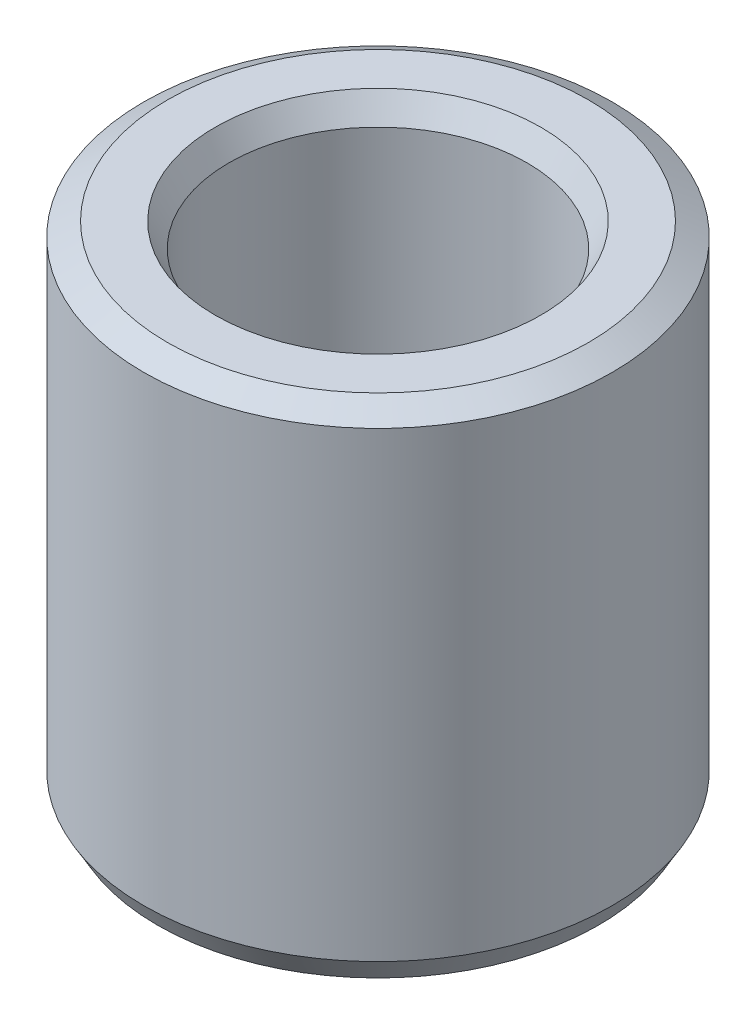
ISO-10303-21;
HEADER;
FILE_DESCRIPTION(('STEP AP214'),'2;1');
FILE_NAME('part.step','',(''),(''),'','','');
FILE_SCHEMA(('AUTOMOTIVE_DESIGN { 1 0 10303 214 1 1 1 1 }'));
ENDSEC;
DATA;
#1=APPLICATION_CONTEXT('core data for automotive mechanical design processes');
#2=APPLICATION_PROTOCOL_DEFINITION('international standard','automotive_design',2000,#1);
#3=PRODUCT_CONTEXT('',#1,'mechanical');
#4=PRODUCT('Part','Part','',(#3));
#5=PRODUCT_RELATED_PRODUCT_CATEGORY('part','',(#4));
#6=PRODUCT_DEFINITION_FORMATION('','',#4);
#7=PRODUCT_DEFINITION_CONTEXT('part definition',#1,'design');
#8=PRODUCT_DEFINITION('design','',#6,#7);
#9=PRODUCT_DEFINITION_SHAPE('','',#8);
#10=(LENGTH_UNIT() NAMED_UNIT(*) SI_UNIT(.MILLI.,.METRE.));
#11=(NAMED_UNIT(*) PLANE_ANGLE_UNIT() SI_UNIT($,.RADIAN.));
#12=(NAMED_UNIT(*) SI_UNIT($,.STERADIAN.) SOLID_ANGLE_UNIT());
#13=UNCERTAINTY_MEASURE_WITH_UNIT(LENGTH_MEASURE(1.E-05),#10,'distance_accuracy_value','');
#14=(GEOMETRIC_REPRESENTATION_CONTEXT(3) GLOBAL_UNCERTAINTY_ASSIGNED_CONTEXT((#13)) GLOBAL_UNIT_ASSIGNED_CONTEXT((#10,
#11,#12)) REPRESENTATION_CONTEXT('',''));
#15=CARTESIAN_POINT('',(0.,0.,0.));
#16=DIRECTION('',(0.,0.,1.));
#17=DIRECTION('',(1.,0.,0.));
#18=AXIS2_PLACEMENT_3D('',#15,#16,#17);
#19=CARTESIAN_POINT('',(0.,95.9526361688887,0.));
#20=DIRECTION('',(0.,-1.,0.));
#21=DIRECTION('',(0.,0.,-1.));
#22=AXIS2_PLACEMENT_3D('',#19,#20,#21);
#23=CYLINDRICAL_SURFACE('',#22,45.);
#24=CARTESIAN_POINT('',(0.,4.59350722809722,0.));
#25=DIRECTION('',(0.,1.,0.));
#26=DIRECTION('',(0.,0.,1.));
#27=AXIS2_PLACEMENT_3D('',#24,#25,#26);
#28=CIRCLE('',#27,45.);
#29=CARTESIAN_POINT('',(0.,4.59350722809722,45.));
#30=VERTEX_POINT('',#29);
#31=EDGE_CURVE('E10',#30,#30,#28,.T.);
#32=ORIENTED_EDGE('',*,*,#31,.T.);
#33=EDGE_LOOP('',(#32));
#34=FACE_BOUND('',#33,.T.);
#35=CARTESIAN_POINT('',(0.,93.3005735342223,0.));
#36=DIRECTION('',(0.,1.,0.));
#37=DIRECTION('',(0.,0.,1.));
#38=AXIS2_PLACEMENT_3D('',#35,#36,#37);
#39=CIRCLE('',#38,45.);
#40=CARTESIAN_POINT('',(0.,93.3005735342223,45.));
#41=VERTEX_POINT('',#40);
#42=EDGE_CURVE('E50',#41,#41,#39,.F.);
#43=ORIENTED_EDGE('',*,*,#42,.T.);
#44=EDGE_LOOP('',(#43));
#45=FACE_BOUND('',#44,.T.);
#46=ADVANCED_FACE('F39',(#34,#45),#23,.T.);
#47=CARTESIAN_POINT('',(0.,95.9526361688887,0.));
#48=DIRECTION('',(0.,1.,0.));
#49=DIRECTION('',(0.,0.,1.));
#50=AXIS2_PLACEMENT_3D('',#47,#48,#49);
#51=PLANE('',#50);
#52=CARTESIAN_POINT('',(0.,95.9526361688887,0.));
#53=DIRECTION('',(0.,1.,0.));
#54=DIRECTION('',(0.,0.,1.));
#55=AXIS2_PLACEMENT_3D('',#52,#53,#54);
#56=CIRCLE('',#55,31.2816265162041);
#57=CARTESIAN_POINT('',(0.,95.9526361688887,31.2816265162041));
#58=VERTEX_POINT('',#57);
#59=EDGE_CURVE('E58',#58,#58,#56,.F.);
#60=ORIENTED_EDGE('',*,*,#59,.T.);
#61=EDGE_LOOP('',(#60));
#62=FACE_BOUND('',#61,.T.);
#63=CARTESIAN_POINT('',(0.,95.9526361688887,0.));
#64=DIRECTION('',(0.,1.,0.));
#65=DIRECTION('',(0.,0.,1.));
#66=AXIS2_PLACEMENT_3D('',#63,#64,#65);
#67=CIRCLE('',#66,40.4064927719028);
#68=CARTESIAN_POINT('',(0.,95.9526361688887,40.4064927719028));
#69=VERTEX_POINT('',#68);
#70=EDGE_CURVE('E61',#69,#69,#67,.T.);
#71=ORIENTED_EDGE('',*,*,#70,.T.);
#72=EDGE_LOOP('',(#71));
#73=FACE_BOUND('',#72,.T.);
#74=ADVANCED_FACE('F88',(#62,#73),#51,.T.);
#75=CARTESIAN_POINT('',(0.,0.,0.));
#76=DIRECTION('',(0.,1.,0.));
#77=DIRECTION('',(0.,0.,1.));
#78=AXIS2_PLACEMENT_3D('',#75,#76,#77);
#79=PLANE('',#78);
#80=CARTESIAN_POINT('',(0.,0.,0.));
#81=DIRECTION('',(0.,1.,0.));
#82=DIRECTION('',(0.,0.,1.));
#83=AXIS2_PLACEMENT_3D('',#80,#81,#82);
#84=CIRCLE('',#83,33.2230711096348);
#85=CARTESIAN_POINT('',(0.,0.,-33.2230711096348));
#86=VERTEX_POINT('',#85);
#87=EDGE_CURVE('E51',#86,#86,#84,.T.);
#88=ORIENTED_EDGE('',*,*,#87,.T.);
#89=EDGE_LOOP('',(#88));
#90=FACE_BOUND('',#89,.T.);
#91=CARTESIAN_POINT('',(0.,0.,0.));
#92=DIRECTION('',(0.,1.,0.));
#93=DIRECTION('',(0.,0.,1.));
#94=AXIS2_PLACEMENT_3D('',#91,#92,#93);
#95=CIRCLE('',#94,42.3479373653336);
#96=CARTESIAN_POINT('',(0.,0.,42.3479373653336));
#97=VERTEX_POINT('',#96);
#98=EDGE_CURVE('E54',#97,#97,#95,.F.);
#99=ORIENTED_EDGE('',*,*,#98,.T.);
#100=EDGE_LOOP('',(#99));
#101=FACE_BOUND('',#100,.T.);
#102=ADVANCED_FACE('F83',(#90,#101),#79,.F.);
#103=CARTESIAN_POINT('',(0.,95.9526361688887,0.));
#104=DIRECTION('',(0.,-1.,0.));
#105=DIRECTION('',(0.,0.,-1.));
#106=AXIS2_PLACEMENT_3D('',#103,#104,#105);
#107=CYLINDRICAL_SURFACE('',#106,28.6295638815376);
#108=CARTESIAN_POINT('',(0.,91.3591289407915,0.));
#109=DIRECTION('',(0.,1.,0.));
#110=DIRECTION('',(0.,0.,1.));
#111=AXIS2_PLACEMENT_3D('',#108,#109,#110);
#112=CIRCLE('',#111,28.6295638815376);
#113=CARTESIAN_POINT('',(0.,91.3591289407915,28.6295638815376));
#114=VERTEX_POINT('',#113);
#115=EDGE_CURVE('E67',#114,#114,#112,.T.);
#116=ORIENTED_EDGE('',*,*,#115,.T.);
#117=EDGE_LOOP('',(#116));
#118=FACE_BOUND('',#117,.T.);
#119=CARTESIAN_POINT('',(0.,2.65206263466644,0.));
#120=DIRECTION('',(0.,1.,0.));
#121=DIRECTION('',(0.,0.,1.));
#122=AXIS2_PLACEMENT_3D('',#119,#120,#121);
#123=CIRCLE('',#122,28.6295638815376);
#124=CARTESIAN_POINT('',(0.,2.65206263466644,-28.6295638815376));
#125=VERTEX_POINT('',#124);
#126=EDGE_CURVE('E69',#125,#125,#123,.F.);
#127=ORIENTED_EDGE('',*,*,#126,.T.);
#128=EDGE_LOOP('',(#127));
#129=FACE_BOUND('',#128,.T.);
#130=ADVANCED_FACE('F71',(#118,#129),#107,.F.);
#131=CARTESIAN_POINT('',(0.,91.3591289407915,0.));
#132=DIRECTION('',(0.,1.,0.));
#133=DIRECTION('',(0.,0.,1.));
#134=AXIS2_PLACEMENT_3D('',#131,#132,#133);
#135=CONICAL_SURFACE('',#134,28.6295638815376,0.523598775598304);
#136=ORIENTED_EDGE('',*,*,#59,.F.);
#137=EDGE_LOOP('',(#136));
#138=FACE_BOUND('',#137,.T.);
#139=ORIENTED_EDGE('',*,*,#115,.F.);
#140=EDGE_LOOP('',(#139));
#141=FACE_BOUND('',#140,.T.);
#142=ADVANCED_FACE('F77',(#138,#141),#135,.F.);
#143=CARTESIAN_POINT('',(0.,0.,0.));
#144=DIRECTION('',(0.,-1.,0.));
#145=DIRECTION('',(0.,0.,-1.));
#146=AXIS2_PLACEMENT_3D('',#143,#144,#145);
#147=CONICAL_SURFACE('',#146,33.2230711096348,1.04719755119659);
#148=CARTESIAN_POINT('',(0.,2.65206263466644,-28.6295638815376));
#149=CARTESIAN_POINT('',(0.,2.624436982222,-28.6774129151636));
#150=CARTESIAN_POINT('',(0.,2.59681132977756,-28.7252619487896));
#151=CARTESIAN_POINT('',(0.,2.54156002488867,-28.8209600160416));
#152=CARTESIAN_POINT('',(0.,2.51393437244423,-28.8688090496676));
#153=CARTESIAN_POINT('',(0.,2.45868306755535,-28.9645071169197));
#154=CARTESIAN_POINT('',(0.,2.4310574151109,-29.0123561505457));
#155=CARTESIAN_POINT('',(0.,2.37580611022202,-29.1080542177977));
#156=CARTESIAN_POINT('',(0.,2.34818045777758,-29.1559032514237));
#157=CARTESIAN_POINT('',(0.,2.29292915288869,-29.2516013186757));
#158=CARTESIAN_POINT('',(0.,2.26530350044425,-29.2994503523018));
#159=CARTESIAN_POINT('',(0.,2.21005219555537,-29.3951484195538));
#160=CARTESIAN_POINT('',(0.,2.18242654311093,-29.4429974531798));
#161=CARTESIAN_POINT('',(0.,2.12717523822204,-29.5386955204318));
#162=CARTESIAN_POINT('',(0.,2.0995495857776,-29.5865445540578));
#163=CARTESIAN_POINT('',(0.,2.04429828088871,-29.6822426213099));
#164=CARTESIAN_POINT('',(0.,2.01667262844427,-29.7300916549359));
#165=CARTESIAN_POINT('',(0.,1.96142132355539,-29.8257897221879));
#166=CARTESIAN_POINT('',(0.,1.93379567111095,-29.8736387558139));
#167=CARTESIAN_POINT('',(0.,1.87854436622206,-29.9693368230659));
#168=CARTESIAN_POINT('',(0.,1.85091871377762,-30.0171858566919));
#169=CARTESIAN_POINT('',(0.,1.79566740888874,-30.112883923944));
#170=CARTESIAN_POINT('',(0.,1.76804175644429,-30.16073295757));
#171=CARTESIAN_POINT('',(0.,1.71279045155541,-30.256431024822));
#172=CARTESIAN_POINT('',(0.,1.68516479911097,-30.304280058448));
#173=CARTESIAN_POINT('',(0.,1.62991349422208,-30.3999781257));
#174=CARTESIAN_POINT('',(0.,1.60228784177764,-30.4478271593261));
#175=CARTESIAN_POINT('',(0.,1.54703653688876,-30.5435252265781));
#176=CARTESIAN_POINT('',(0.,1.51941088444432,-30.5913742602041));
#177=CARTESIAN_POINT('',(0.,1.46415957955543,-30.6870723274561));
#178=CARTESIAN_POINT('',(0.,1.43653392711099,-30.7349213610821));
#179=CARTESIAN_POINT('',(0.,1.3812826222221,-30.8306194283342));
#180=CARTESIAN_POINT('',(0.,1.35365696977766,-30.8784684619602));
#181=CARTESIAN_POINT('',(0.,1.29840566488878,-30.9741665292122));
#182=CARTESIAN_POINT('',(0.,1.27078001244434,-31.0220155628382));
#183=CARTESIAN_POINT('',(0.,1.21552870755545,-31.1177136300902));
#184=CARTESIAN_POINT('',(0.,1.18790305511101,-31.1655626637163));
#185=CARTESIAN_POINT('',(0.,1.13265175022213,-31.2612607309683));
#186=CARTESIAN_POINT('',(0.,1.10502609777768,-31.3091097645943));
#187=CARTESIAN_POINT('',(0.,1.0497747928888,-31.4048078318463));
#188=CARTESIAN_POINT('',(0.,1.02214914044436,-31.4526568654723));
#189=CARTESIAN_POINT('',(0.,0.966897835555474,-31.5483549327244));
#190=CARTESIAN_POINT('',(0.,0.939272183111031,-31.5962039663504));
#191=CARTESIAN_POINT('',(0.,0.884020878222147,-31.6919020336024));
#192=CARTESIAN_POINT('',(0.,0.856395225777705,-31.7397510672284));
#193=CARTESIAN_POINT('',(0.,0.801143920888821,-31.8354491344804));
#194=CARTESIAN_POINT('',(0.,0.773518268444378,-31.8832981681064));
#195=CARTESIAN_POINT('',(0.,0.718266963555494,-31.9789962353585));
#196=CARTESIAN_POINT('',(0.,0.690641311111053,-32.0268452689845));
#197=CARTESIAN_POINT('',(0.,0.635390006222169,-32.1225433362365));
#198=CARTESIAN_POINT('',(0.,0.607764353777726,-32.1703923698625));
#199=CARTESIAN_POINT('',(0.,0.552513048888841,-32.2660904371145));
#200=CARTESIAN_POINT('',(0.,0.524887396444399,-32.3139394707406));
#201=CARTESIAN_POINT('',(0.,0.469636091555515,-32.4096375379926));
#202=CARTESIAN_POINT('',(0.,0.442010439111074,-32.4574865716186));
#203=CARTESIAN_POINT('',(0.,0.38675913422219,-32.5531846388706));
#204=CARTESIAN_POINT('',(0.,0.359133481777747,-32.6010336724966));
#205=CARTESIAN_POINT('',(0.,0.303882176888863,-32.6967317397487));
#206=CARTESIAN_POINT('',(0.,0.276256524444421,-32.7445807733747));
#207=CARTESIAN_POINT('',(0.,0.221005219555537,-32.8402788406267));
#208=CARTESIAN_POINT('',(0.,0.193379567111094,-32.8881278742527));
#209=CARTESIAN_POINT('',(0.,0.13812826222221,-32.9838259415047));
#210=CARTESIAN_POINT('',(0.,0.110502609777768,-33.0316749751307));
#211=CARTESIAN_POINT('',(0.,0.0552513048888852,-33.1273730423828));
#212=CARTESIAN_POINT('',(0.,0.0276256524444436,-33.1752220760088));
#213=CARTESIAN_POINT('',(0.,0.,-33.2230711096348));
#214=B_SPLINE_CURVE_WITH_KNOTS('',3,(#148,#149,#150,#151,#152,#153,#154,#155,#156,#157,#158,
#159,#160,#161,#162,#163,#164,#165,#166,#167,#168,#169,#170,#171,#172,#173,#174,#175,#176,#177,
#178,#179,#180,#181,#182,#183,#184,#185,#186,#187,#188,#189,#190,#191,#192,#193,#194,#195,#196,
#197,#198,#199,#200,#201,#202,#203,#204,#205,#206,#207,#208,#209,#210,#211,#212,#213),
.UNSPECIFIED.,.F.,.F.,(4,2,2,2,2,2,2,2,2,2,2,2,2,2,2,2,2,2,2,2,2,2,2,2,2,2,2,2,2,2,2,2,4),(0.,
0.165753914666653,0.331507829333302,0.497261743999955,0.663015658666605,0.828769573333258,
0.99452348799991,1.16027740266656,1.32603131733321,1.49178523199986,1.65753914666652,
1.82329306133317,1.98904697599982,2.15480089066647,2.32055480533312,2.48630871999977,
2.65206263466642,2.81781654933307,2.98357046399972,3.14932437866637,3.31507829333303,
3.48083220799968,3.64658612266633,3.81234003733298,3.97809395199963,4.14384786666628,
4.30960178133293,4.47535569599959,4.64110961066624,4.80686352533289,4.97261743999954,
5.1383713546662,5.30412526933285),.UNSPECIFIED.);
#215=EDGE_CURVE('BSEAM73',#125,#86,#214,.T.);
#216=ORIENTED_EDGE('',*,*,#126,.F.);
#217=ORIENTED_EDGE('',*,*,#87,.F.);
#218=ORIENTED_EDGE('',*,*,#215,.T.);
#219=ORIENTED_EDGE('',*,*,#215,.F.);
#220=EDGE_LOOP('',(#216,#218,#217,#219));
#221=FACE_BOUND('',#220,.T.);
#222=ADVANCED_FACE('F73',(#221),#147,.F.);
#223=CARTESIAN_POINT('',(0.,4.59350722809722,0.));
#224=DIRECTION('',(0.,1.,0.));
#225=DIRECTION('',(0.,0.,1.));
#226=AXIS2_PLACEMENT_3D('',#223,#224,#225);
#227=CONICAL_SURFACE('',#226,45.,0.523598775598303);
#228=ORIENTED_EDGE('',*,*,#98,.F.);
#229=EDGE_LOOP('',(#228));
#230=FACE_BOUND('',#229,.T.);
#231=ORIENTED_EDGE('',*,*,#31,.F.);
#232=EDGE_LOOP('',(#231));
#233=FACE_BOUND('',#232,.T.);
#234=ADVANCED_FACE('F76',(#230,#233),#227,.T.);
#235=CARTESIAN_POINT('',(0.,95.9526361688887,0.));
#236=DIRECTION('',(0.,-1.,0.));
#237=DIRECTION('',(0.,0.,-1.));
#238=AXIS2_PLACEMENT_3D('',#235,#236,#237);
#239=CONICAL_SURFACE('',#238,40.4064927719028,1.04719755119659);
#240=ORIENTED_EDGE('',*,*,#42,.F.);
#241=EDGE_LOOP('',(#240));
#242=FACE_BOUND('',#241,.T.);
#243=ORIENTED_EDGE('',*,*,#70,.F.);
#244=EDGE_LOOP('',(#243));
#245=FACE_BOUND('',#244,.T.);
#246=ADVANCED_FACE('F45',(#242,#245),#239,.T.);
#247=CLOSED_SHELL('',(#46,#74,#102,#130,#142,#222,#234,#246));
#248=MANIFOLD_SOLID_BREP('B2',#247);
#249=ADVANCED_BREP_SHAPE_REPRESENTATION('',(#18,#248),#14);
#250=SHAPE_DEFINITION_REPRESENTATION(#9,#249);
ENDSEC;
END-ISO-10303-21;
